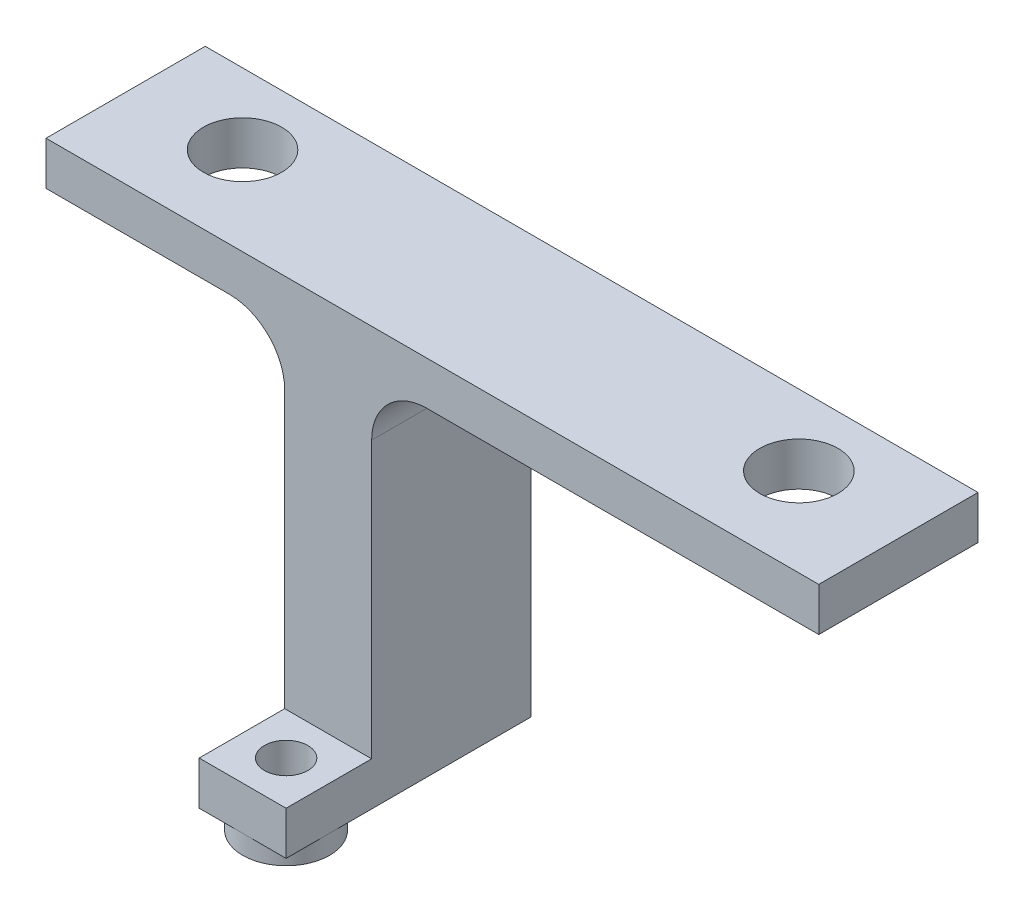
ISO-10303-21;
HEADER;
FILE_DESCRIPTION(('STEP AP214'),'2;1');
FILE_NAME('part.step','',(''),(''),'','','');
FILE_SCHEMA(('AUTOMOTIVE_DESIGN { 1 0 10303 214 1 1 1 1 }'));
ENDSEC;
DATA;
#1=APPLICATION_CONTEXT('core data for automotive mechanical design processes');
#2=APPLICATION_PROTOCOL_DEFINITION('international standard','automotive_design',2000,#1);
#3=PRODUCT_CONTEXT('',#1,'mechanical');
#4=PRODUCT('Part','Part','',(#3));
#5=PRODUCT_RELATED_PRODUCT_CATEGORY('part','',(#4));
#6=PRODUCT_DEFINITION_FORMATION('','',#4);
#7=PRODUCT_DEFINITION_CONTEXT('part definition',#1,'design');
#8=PRODUCT_DEFINITION('design','',#6,#7);
#9=PRODUCT_DEFINITION_SHAPE('','',#8);
#10=(LENGTH_UNIT() NAMED_UNIT(*) SI_UNIT(.MILLI.,.METRE.));
#11=(NAMED_UNIT(*) PLANE_ANGLE_UNIT() SI_UNIT($,.RADIAN.));
#12=(NAMED_UNIT(*) SI_UNIT($,.STERADIAN.) SOLID_ANGLE_UNIT());
#13=UNCERTAINTY_MEASURE_WITH_UNIT(LENGTH_MEASURE(1.E-05),#10,'distance_accuracy_value','');
#14=(GEOMETRIC_REPRESENTATION_CONTEXT(3) GLOBAL_UNCERTAINTY_ASSIGNED_CONTEXT((#13)) GLOBAL_UNIT_ASSIGNED_CONTEXT((#10,
#11,#12)) REPRESENTATION_CONTEXT('',''));
#15=CARTESIAN_POINT('',(0.,0.,0.));
#16=DIRECTION('',(0.,0.,1.));
#17=DIRECTION('',(1.,0.,0.));
#18=AXIS2_PLACEMENT_3D('',#15,#16,#17);
#19=CARTESIAN_POINT('',(0.,0.,0.));
#20=DIRECTION('',(0.,-1.,0.));
#21=DIRECTION('',(0.,0.,-1.));
#22=AXIS2_PLACEMENT_3D('',#19,#20,#21);
#23=PLANE('',#22);
#24=CARTESIAN_POINT('',(16.,0.,0.));
#25=DIRECTION('',(0.,1.,0.));
#26=DIRECTION('',(0.,0.,1.));
#27=AXIS2_PLACEMENT_3D('',#24,#25,#26);
#28=CIRCLE('',#27,2.25);
#29=CARTESIAN_POINT('',(16.,0.,2.25));
#30=VERTEX_POINT('',#29);
#31=EDGE_CURVE('E293',#30,#30,#28,.T.);
#32=ORIENTED_EDGE('',*,*,#31,.T.);
#33=EDGE_LOOP('',(#32));
#34=FACE_BOUND('',#33,.T.);
#35=DIRECTION('',(0.,0.,1.));
#36=VECTOR('',#35,1.);
#37=CARTESIAN_POINT('',(-0.319400000000001,0.,0.));
#38=LINE('',#37,#36);
#39=CARTESIAN_POINT('',(-0.319400000000001,0.,5.08));
#40=VERTEX_POINT('',#39);
#41=CARTESIAN_POINT('',(-0.319400000000001,0.,-4.08));
#42=VERTEX_POINT('',#41);
#43=EDGE_CURVE('E156',#40,#42,#38,.F.);
#44=ORIENTED_EDGE('',*,*,#43,.T.);
#45=DIRECTION('',(-1.,0.,0.));
#46=VECTOR('',#45,1.);
#47=CARTESIAN_POINT('',(22.225,0.,-4.08));
#48=LINE('',#47,#46);
#49=CARTESIAN_POINT('',(22.225,0.,-4.08));
#50=VERTEX_POINT('',#49);
#51=EDGE_CURVE('E140',#50,#42,#48,.T.);
#52=ORIENTED_EDGE('',*,*,#51,.F.);
#53=DIRECTION('',(0.,0.,-1.));
#54=VECTOR('',#53,1.);
#55=CARTESIAN_POINT('',(22.225,0.,5.08));
#56=LINE('',#55,#54);
#57=CARTESIAN_POINT('',(22.225,0.,5.08));
#58=VERTEX_POINT('',#57);
#59=EDGE_CURVE('E154',#58,#50,#56,.T.);
#60=ORIENTED_EDGE('',*,*,#59,.F.);
#61=DIRECTION('',(1.,0.,0.));
#62=VECTOR('',#61,1.);
#63=CARTESIAN_POINT('',(-22.225,0.,5.08));
#64=LINE('',#63,#62);
#65=EDGE_CURVE('E170',#40,#58,#64,.T.);
#66=ORIENTED_EDGE('',*,*,#65,.F.);
#67=EDGE_LOOP('',(#44,#52,#60,#66));
#68=FACE_BOUND('',#67,.T.);
#69=ADVANCED_FACE('F39',(#34,#68),#23,.T.);
#70=CARTESIAN_POINT('',(0.,2.5,0.));
#71=DIRECTION('',(0.,-1.,0.));
#72=DIRECTION('',(0.,0.,-1.));
#73=AXIS2_PLACEMENT_3D('',#70,#71,#72);
#74=PLANE('',#73);
#75=CARTESIAN_POINT('',(16.,2.5,0.));
#76=DIRECTION('',(0.,1.,0.));
#77=DIRECTION('',(0.,0.,1.));
#78=AXIS2_PLACEMENT_3D('',#75,#76,#77);
#79=CIRCLE('',#78,2.25);
#80=CARTESIAN_POINT('',(16.,2.5,2.25));
#81=VERTEX_POINT('',#80);
#82=EDGE_CURVE('E294',#81,#81,#79,.T.);
#83=ORIENTED_EDGE('',*,*,#82,.F.);
#84=EDGE_LOOP('',(#83));
#85=FACE_BOUND('',#84,.T.);
#86=CARTESIAN_POINT('',(-16.,2.5,0.));
#87=DIRECTION('',(0.,1.,0.));
#88=DIRECTION('',(0.,0.,1.));
#89=AXIS2_PLACEMENT_3D('',#86,#87,#88);
#90=CIRCLE('',#89,2.25);
#91=CARTESIAN_POINT('',(-16.,2.5,2.25));
#92=VERTEX_POINT('',#91);
#93=EDGE_CURVE('E166',#92,#92,#90,.T.);
#94=ORIENTED_EDGE('',*,*,#93,.F.);
#95=EDGE_LOOP('',(#94));
#96=FACE_BOUND('',#95,.T.);
#97=DIRECTION('',(1.,0.,0.));
#98=VECTOR('',#97,1.);
#99=CARTESIAN_POINT('',(-22.225,2.5,-4.08));
#100=LINE('',#99,#98);
#101=CARTESIAN_POINT('',(-22.225,2.5,-4.08));
#102=VERTEX_POINT('',#101);
#103=CARTESIAN_POINT('',(22.225,2.5,-4.08));
#104=VERTEX_POINT('',#103);
#105=EDGE_CURVE('E143',#102,#104,#100,.T.);
#106=ORIENTED_EDGE('',*,*,#105,.F.);
#107=DIRECTION('',(0.,0.,1.));
#108=VECTOR('',#107,1.);
#109=CARTESIAN_POINT('',(-22.225,2.5,5.08));
#110=LINE('',#109,#108);
#111=CARTESIAN_POINT('',(-22.225,2.5,5.08));
#112=VERTEX_POINT('',#111);
#113=EDGE_CURVE('E305',#102,#112,#110,.T.);
#114=ORIENTED_EDGE('',*,*,#113,.T.);
#115=DIRECTION('',(1.,0.,0.));
#116=VECTOR('',#115,1.);
#117=CARTESIAN_POINT('',(-22.225,2.5,5.08));
#118=LINE('',#117,#116);
#119=CARTESIAN_POINT('',(22.225,2.5,5.08));
#120=VERTEX_POINT('',#119);
#121=EDGE_CURVE('E176',#112,#120,#118,.T.);
#122=ORIENTED_EDGE('',*,*,#121,.T.);
#123=DIRECTION('',(0.,0.,-1.));
#124=VECTOR('',#123,1.);
#125=CARTESIAN_POINT('',(22.225,2.5,5.08));
#126=LINE('',#125,#124);
#127=EDGE_CURVE('E182',#120,#104,#126,.T.);
#128=ORIENTED_EDGE('',*,*,#127,.T.);
#129=EDGE_LOOP('',(#106,#114,#122,#128));
#130=FACE_BOUND('',#129,.T.);
#131=ADVANCED_FACE('F312',(#85,#96,#130),#74,.F.);
#132=CARTESIAN_POINT('',(-16.,0.,0.));
#133=DIRECTION('',(0.,1.,0.));
#134=DIRECTION('',(0.,0.,1.));
#135=AXIS2_PLACEMENT_3D('',#132,#133,#134);
#136=CIRCLE('',#135,2.25);
#137=CARTESIAN_POINT('',(-16.,0.,2.25));
#138=VERTEX_POINT('',#137);
#139=EDGE_CURVE('E173',#138,#138,#136,.T.);
#140=ORIENTED_EDGE('',*,*,#139,.T.);
#141=EDGE_LOOP('',(#140));
#142=FACE_BOUND('',#141,.T.);
#143=DIRECTION('',(0.,0.,1.));
#144=VECTOR('',#143,1.);
#145=CARTESIAN_POINT('',(-22.225,0.,5.08));
#146=LINE('',#145,#144);
#147=CARTESIAN_POINT('',(-22.225,0.,-4.08));
#148=VERTEX_POINT('',#147);
#149=CARTESIAN_POINT('',(-22.225,0.,5.08));
#150=VERTEX_POINT('',#149);
#151=EDGE_CURVE('E165',#148,#150,#146,.T.);
#152=ORIENTED_EDGE('',*,*,#151,.F.);
#153=DIRECTION('',(-1.,0.,0.));
#154=VECTOR('',#153,1.);
#155=CARTESIAN_POINT('',(-11.6694,0.,-4.08));
#156=LINE('',#155,#154);
#157=CARTESIAN_POINT('',(-11.6694,0.,-4.08));
#158=VERTEX_POINT('',#157);
#159=EDGE_CURVE('E227',#158,#148,#156,.T.);
#160=ORIENTED_EDGE('',*,*,#159,.F.);
#161=DIRECTION('',(0.,0.,-1.));
#162=VECTOR('',#161,1.);
#163=CARTESIAN_POINT('',(-11.6694,0.,0.));
#164=LINE('',#163,#162);
#165=CARTESIAN_POINT('',(-11.6694,0.,5.08));
#166=VERTEX_POINT('',#165);
#167=EDGE_CURVE('E63',#158,#166,#164,.F.);
#168=ORIENTED_EDGE('',*,*,#167,.T.);
#169=EDGE_CURVE('E179',#150,#166,#64,.T.);
#170=ORIENTED_EDGE('',*,*,#169,.F.);
#171=EDGE_LOOP('',(#152,#160,#168,#170));
#172=FACE_BOUND('',#171,.T.);
#173=ADVANCED_FACE('F316',(#142,#172),#23,.T.);
#174=CARTESIAN_POINT('',(22.225,2.5,5.08));
#175=DIRECTION('',(-1.,0.,0.));
#176=DIRECTION('',(0.,0.,1.));
#177=AXIS2_PLACEMENT_3D('',#174,#175,#176);
#178=PLANE('',#177);
#179=DIRECTION('',(0.,-1.,0.));
#180=VECTOR('',#179,1.);
#181=CARTESIAN_POINT('',(22.225,2.5,-4.08));
#182=LINE('',#181,#180);
#183=EDGE_CURVE('E137',#104,#50,#182,.T.);
#184=ORIENTED_EDGE('',*,*,#183,.F.);
#185=ORIENTED_EDGE('',*,*,#127,.F.);
#186=DIRECTION('',(0.,-1.,0.));
#187=VECTOR('',#186,1.);
#188=CARTESIAN_POINT('',(22.225,2.5,5.08));
#189=LINE('',#188,#187);
#190=EDGE_CURVE('E163',#120,#58,#189,.T.);
#191=ORIENTED_EDGE('',*,*,#190,.T.);
#192=ORIENTED_EDGE('',*,*,#59,.T.);
#193=EDGE_LOOP('',(#184,#185,#191,#192));
#194=FACE_BOUND('',#193,.T.);
#195=ADVANCED_FACE('F161',(#194),#178,.F.);
#196=CARTESIAN_POINT('',(-22.225,2.5,5.08));
#197=DIRECTION('',(1.,0.,0.));
#198=DIRECTION('',(0.,0.,-1.));
#199=AXIS2_PLACEMENT_3D('',#196,#197,#198);
#200=PLANE('',#199);
#201=DIRECTION('',(0.,1.,0.));
#202=VECTOR('',#201,1.);
#203=CARTESIAN_POINT('',(-22.225,0.,-4.08));
#204=LINE('',#203,#202);
#205=EDGE_CURVE('E230',#148,#102,#204,.T.);
#206=ORIENTED_EDGE('',*,*,#205,.F.);
#207=ORIENTED_EDGE('',*,*,#151,.T.);
#208=DIRECTION('',(0.,-1.,0.));
#209=VECTOR('',#208,1.);
#210=CARTESIAN_POINT('',(-22.225,2.5,5.08));
#211=LINE('',#210,#209);
#212=EDGE_CURVE('E185',#112,#150,#211,.T.);
#213=ORIENTED_EDGE('',*,*,#212,.F.);
#214=ORIENTED_EDGE('',*,*,#113,.F.);
#215=EDGE_LOOP('',(#206,#207,#213,#214));
#216=FACE_BOUND('',#215,.T.);
#217=ADVANCED_FACE('F318',(#216),#200,.F.);
#218=CARTESIAN_POINT('',(-3.4944,-19.05,-5.08));
#219=DIRECTION('',(-1.,0.,0.));
#220=DIRECTION('',(0.,0.,1.));
#221=AXIS2_PLACEMENT_3D('',#218,#219,#220);
#222=PLANE('',#221);
#223=DIRECTION('',(0.,-1.,0.));
#224=VECTOR('',#223,1.);
#225=CARTESIAN_POINT('',(-3.4944,-3.17500000000001,-4.08));
#226=LINE('',#225,#224);
#227=CARTESIAN_POINT('',(-3.4944,-3.17500000000001,-4.08));
#228=VERTEX_POINT('',#227);
#229=CARTESIAN_POINT('',(-3.4944,-21.55,-4.08));
#230=VERTEX_POINT('',#229);
#231=EDGE_CURVE('E214',#228,#230,#226,.T.);
#232=ORIENTED_EDGE('',*,*,#231,.F.);
#233=DIRECTION('',(0.,0.,1.));
#234=VECTOR('',#233,1.);
#235=CARTESIAN_POINT('',(-3.4944,-3.175,-5.08));
#236=LINE('',#235,#234);
#237=CARTESIAN_POINT('',(-3.4944,-3.17500000000001,5.08));
#238=VERTEX_POINT('',#237);
#239=EDGE_CURVE('E190',#228,#238,#236,.T.);
#240=ORIENTED_EDGE('',*,*,#239,.T.);
#241=DIRECTION('',(0.,1.,0.));
#242=VECTOR('',#241,1.);
#243=CARTESIAN_POINT('',(-3.4944,-19.05,5.08));
#244=LINE('',#243,#242);
#245=CARTESIAN_POINT('',(-3.4944,-19.05,5.08));
#246=VERTEX_POINT('',#245);
#247=EDGE_CURVE('E207',#246,#238,#244,.T.);
#248=ORIENTED_EDGE('',*,*,#247,.F.);
#249=DIRECTION('',(0.,0.,1.));
#250=VECTOR('',#249,1.);
#251=CARTESIAN_POINT('',(-3.4944,-19.05,10.));
#252=LINE('',#251,#250);
#253=CARTESIAN_POINT('',(-3.4944,-19.05,10.));
#254=VERTEX_POINT('',#253);
#255=EDGE_CURVE('E251',#246,#254,#252,.T.);
#256=ORIENTED_EDGE('',*,*,#255,.T.);
#257=DIRECTION('',(0.,1.,0.));
#258=VECTOR('',#257,1.);
#259=CARTESIAN_POINT('',(-3.4944,-21.55,10.));
#260=LINE('',#259,#258);
#261=CARTESIAN_POINT('',(-3.4944,-21.55,10.));
#262=VERTEX_POINT('',#261);
#263=EDGE_CURVE('E279',#262,#254,#260,.T.);
#264=ORIENTED_EDGE('',*,*,#263,.F.);
#265=DIRECTION('',(0.,0.,1.));
#266=VECTOR('',#265,1.);
#267=CARTESIAN_POINT('',(-3.4944,-21.55,10.));
#268=LINE('',#267,#266);
#269=CARTESIAN_POINT('',(-3.4944,-21.55,7.5));
#270=VERTEX_POINT('',#269);
#271=EDGE_CURVE('E256',#270,#262,#268,.T.);
#272=ORIENTED_EDGE('',*,*,#271,.F.);
#273=EDGE_CURVE('E252',#230,#270,#268,.T.);
#274=ORIENTED_EDGE('',*,*,#273,.F.);
#275=EDGE_LOOP('',(#232,#240,#248,#256,#264,#272,#274));
#276=FACE_BOUND('',#275,.T.);
#277=ADVANCED_FACE('F332',(#276),#222,.F.);
#278=CARTESIAN_POINT('',(-8.4944,-19.05,-5.08));
#279=DIRECTION('',(1.,0.,0.));
#280=DIRECTION('',(0.,0.,-1.));
#281=AXIS2_PLACEMENT_3D('',#278,#279,#280);
#282=PLANE('',#281);
#283=DIRECTION('',(0.,1.,0.));
#284=VECTOR('',#283,1.);
#285=CARTESIAN_POINT('',(-8.4944,-21.55,-4.08));
#286=LINE('',#285,#284);
#287=CARTESIAN_POINT('',(-8.4944,-21.55,-4.08));
#288=VERTEX_POINT('',#287);
#289=CARTESIAN_POINT('',(-8.4944,-3.175,-4.08));
#290=VERTEX_POINT('',#289);
#291=EDGE_CURVE('E55',#288,#290,#286,.T.);
#292=ORIENTED_EDGE('',*,*,#291,.F.);
#293=DIRECTION('',(0.,0.,-1.));
#294=VECTOR('',#293,1.);
#295=CARTESIAN_POINT('',(-8.4944,-21.55,10.));
#296=LINE('',#295,#294);
#297=CARTESIAN_POINT('',(-8.4944,-21.55,7.5));
#298=VERTEX_POINT('',#297);
#299=EDGE_CURVE('E261',#298,#288,#296,.T.);
#300=ORIENTED_EDGE('',*,*,#299,.F.);
#301=CARTESIAN_POINT('',(-8.4944,-21.55,10.));
#302=VERTEX_POINT('',#301);
#303=EDGE_CURVE('E262',#302,#298,#296,.T.);
#304=ORIENTED_EDGE('',*,*,#303,.F.);
#305=DIRECTION('',(0.,1.,0.));
#306=VECTOR('',#305,1.);
#307=CARTESIAN_POINT('',(-8.4944,-21.55,10.));
#308=LINE('',#307,#306);
#309=CARTESIAN_POINT('',(-8.4944,-19.05,10.));
#310=VERTEX_POINT('',#309);
#311=EDGE_CURVE('E266',#302,#310,#308,.T.);
#312=ORIENTED_EDGE('',*,*,#311,.T.);
#313=DIRECTION('',(0.,0.,-1.));
#314=VECTOR('',#313,1.);
#315=CARTESIAN_POINT('',(-8.4944,-19.05,10.));
#316=LINE('',#315,#314);
#317=CARTESIAN_POINT('',(-8.4944,-19.05,5.08));
#318=VERTEX_POINT('',#317);
#319=EDGE_CURVE('E272',#310,#318,#316,.T.);
#320=ORIENTED_EDGE('',*,*,#319,.T.);
#321=DIRECTION('',(0.,1.,0.));
#322=VECTOR('',#321,1.);
#323=CARTESIAN_POINT('',(-8.4944,-19.05,5.08));
#324=LINE('',#323,#322);
#325=CARTESIAN_POINT('',(-8.4944,-3.17500000000001,5.08));
#326=VERTEX_POINT('',#325);
#327=EDGE_CURVE('E287',#318,#326,#324,.T.);
#328=ORIENTED_EDGE('',*,*,#327,.T.);
#329=DIRECTION('',(0.,0.,-1.));
#330=VECTOR('',#329,1.);
#331=CARTESIAN_POINT('',(-8.4944,-3.175,-5.08));
#332=LINE('',#331,#330);
#333=EDGE_CURVE('E196',#326,#290,#332,.T.);
#334=ORIENTED_EDGE('',*,*,#333,.T.);
#335=EDGE_LOOP('',(#292,#300,#304,#312,#320,#328,#334));
#336=FACE_BOUND('',#335,.T.);
#337=ADVANCED_FACE('F322',(#336),#282,.F.);
#338=CARTESIAN_POINT('',(0.,-21.55,0.));
#339=DIRECTION('',(0.,-1.,0.));
#340=DIRECTION('',(0.,0.,-1.));
#341=AXIS2_PLACEMENT_3D('',#338,#339,#340);
#342=PLANE('',#341);
#343=ORIENTED_EDGE('',*,*,#299,.T.);
#344=DIRECTION('',(-1.,0.,0.));
#345=VECTOR('',#344,1.);
#346=CARTESIAN_POINT('',(-3.4944,-21.55,-4.08));
#347=LINE('',#346,#345);
#348=EDGE_CURVE('E217',#230,#288,#347,.T.);
#349=ORIENTED_EDGE('',*,*,#348,.F.);
#350=ORIENTED_EDGE('',*,*,#273,.T.);
#351=CARTESIAN_POINT('',(-5.9944,-21.55,7.5));
#352=DIRECTION('',(0.,-1.,0.));
#353=DIRECTION('',(0.,0.,-1.));
#354=AXIS2_PLACEMENT_3D('',#351,#352,#353);
#355=CIRCLE('',#354,2.5);
#356=EDGE_CURVE('E189',#298,#270,#355,.T.);
#357=ORIENTED_EDGE('',*,*,#356,.F.);
#358=EDGE_LOOP('',(#343,#349,#350,#357));
#359=FACE_BOUND('',#358,.T.);
#360=ADVANCED_FACE('F337',(#359),#342,.T.);
#361=CARTESIAN_POINT('',(-0.319400000000001,-3.175,-5.08));
#362=DIRECTION('',(0.,0.,1.));
#363=DIRECTION('',(1.,0.,0.));
#364=AXIS2_PLACEMENT_3D('',#361,#362,#363);
#365=CYLINDRICAL_SURFACE('',#364,3.175);
#366=CARTESIAN_POINT('',(-0.319400000000001,-3.175,-4.08));
#367=DIRECTION('',(0.,0.,1.));
#368=DIRECTION('',(-1.,0.,0.));
#369=AXIS2_PLACEMENT_3D('',#366,#367,#368);
#370=CIRCLE('',#369,3.175);
#371=EDGE_CURVE('E158',#42,#228,#370,.T.);
#372=ORIENTED_EDGE('',*,*,#371,.F.);
#373=ORIENTED_EDGE('',*,*,#43,.F.);
#374=CARTESIAN_POINT('',(-0.3194,-3.175,5.08));
#375=DIRECTION('',(0.,0.,-1.));
#376=DIRECTION('',(-1.,0.,0.));
#377=AXIS2_PLACEMENT_3D('',#374,#375,#376);
#378=CIRCLE('',#377,3.175);
#379=EDGE_CURVE('E48',#238,#40,#378,.T.);
#380=ORIENTED_EDGE('',*,*,#379,.F.);
#381=ORIENTED_EDGE('',*,*,#239,.F.);
#382=EDGE_LOOP('',(#372,#373,#380,#381));
#383=FACE_BOUND('',#382,.T.);
#384=ADVANCED_FACE('F211',(#383),#365,.F.);
#385=CARTESIAN_POINT('',(-11.6694,-3.175,-5.08));
#386=DIRECTION('',(0.,0.,-1.));
#387=DIRECTION('',(-1.,0.,0.));
#388=AXIS2_PLACEMENT_3D('',#385,#386,#387);
#389=CYLINDRICAL_SURFACE('',#388,3.175);
#390=CARTESIAN_POINT('',(-11.6694,-3.175,-4.08));
#391=DIRECTION('',(0.,0.,1.));
#392=DIRECTION('',(-1.,0.,0.));
#393=AXIS2_PLACEMENT_3D('',#390,#391,#392);
#394=CIRCLE('',#393,3.175);
#395=EDGE_CURVE('E224',#290,#158,#394,.T.);
#396=ORIENTED_EDGE('',*,*,#395,.F.);
#397=ORIENTED_EDGE('',*,*,#333,.F.);
#398=CARTESIAN_POINT('',(-11.6694,-3.175,5.08));
#399=DIRECTION('',(0.,0.,-1.));
#400=DIRECTION('',(-1.,0.,0.));
#401=AXIS2_PLACEMENT_3D('',#398,#399,#400);
#402=CIRCLE('',#401,3.175);
#403=EDGE_CURVE('E11',#166,#326,#402,.T.);
#404=ORIENTED_EDGE('',*,*,#403,.F.);
#405=ORIENTED_EDGE('',*,*,#167,.F.);
#406=EDGE_LOOP('',(#396,#397,#404,#405));
#407=FACE_BOUND('',#406,.T.);
#408=ADVANCED_FACE('F41',(#407),#389,.F.);
#409=CARTESIAN_POINT('',(-5.9944,-21.55,10.));
#410=VERTEX_POINT('',#409);
#411=EDGE_CURVE('E239',#270,#410,#355,.T.);
#412=ORIENTED_EDGE('',*,*,#411,.F.);
#413=ORIENTED_EDGE('',*,*,#271,.T.);
#414=DIRECTION('',(-1.,0.,0.));
#415=VECTOR('',#414,1.);
#416=CARTESIAN_POINT('',(-8.4944,-21.55,10.));
#417=LINE('',#416,#415);
#418=EDGE_CURVE('E257',#262,#410,#417,.T.);
#419=ORIENTED_EDGE('',*,*,#418,.T.);
#420=EDGE_LOOP('',(#412,#413,#419));
#421=FACE_BOUND('',#420,.T.);
#422=ADVANCED_FACE('F346',(#421),#342,.T.);
#423=EDGE_CURVE('E193',#410,#298,#355,.T.);
#424=ORIENTED_EDGE('',*,*,#423,.F.);
#425=EDGE_CURVE('E255',#410,#302,#417,.T.);
#426=ORIENTED_EDGE('',*,*,#425,.T.);
#427=ORIENTED_EDGE('',*,*,#303,.T.);
#428=EDGE_LOOP('',(#424,#426,#427));
#429=FACE_BOUND('',#428,.T.);
#430=ADVANCED_FACE('F352',(#429),#342,.T.);
#431=CARTESIAN_POINT('',(-22.225,2.5,5.08));
#432=DIRECTION('',(0.,0.,-1.));
#433=DIRECTION('',(-1.,0.,0.));
#434=AXIS2_PLACEMENT_3D('',#431,#432,#433);
#435=PLANE('',#434);
#436=ORIENTED_EDGE('',*,*,#169,.T.);
#437=ORIENTED_EDGE('',*,*,#403,.T.);
#438=ORIENTED_EDGE('',*,*,#327,.F.);
#439=DIRECTION('',(-1.,0.,0.));
#440=VECTOR('',#439,1.);
#441=CARTESIAN_POINT('',(-8.4944,-19.05,5.08));
#442=LINE('',#441,#440);
#443=EDGE_CURVE('E283',#246,#318,#442,.T.);
#444=ORIENTED_EDGE('',*,*,#443,.F.);
#445=ORIENTED_EDGE('',*,*,#247,.T.);
#446=ORIENTED_EDGE('',*,*,#379,.T.);
#447=ORIENTED_EDGE('',*,*,#65,.T.);
#448=ORIENTED_EDGE('',*,*,#190,.F.);
#449=ORIENTED_EDGE('',*,*,#121,.F.);
#450=ORIENTED_EDGE('',*,*,#212,.T.);
#451=EDGE_LOOP('',(#436,#437,#438,#444,#445,#446,#447,#448,#449,#450));
#452=FACE_BOUND('',#451,.T.);
#453=ADVANCED_FACE('F205',(#452),#435,.F.);
#454=CARTESIAN_POINT('',(-16.,2.5,0.));
#455=DIRECTION('',(0.,-1.,0.));
#456=DIRECTION('',(0.,0.,-1.));
#457=AXIS2_PLACEMENT_3D('',#454,#455,#456);
#458=CYLINDRICAL_SURFACE('',#457,2.25);
#459=ORIENTED_EDGE('',*,*,#93,.T.);
#460=EDGE_LOOP('',(#459));
#461=FACE_BOUND('',#460,.T.);
#462=ORIENTED_EDGE('',*,*,#139,.F.);
#463=EDGE_LOOP('',(#462));
#464=FACE_BOUND('',#463,.T.);
#465=ADVANCED_FACE('F389',(#461,#464),#458,.F.);
#466=CARTESIAN_POINT('',(16.,2.5,0.));
#467=DIRECTION('',(0.,-1.,0.));
#468=DIRECTION('',(0.,0.,-1.));
#469=AXIS2_PLACEMENT_3D('',#466,#467,#468);
#470=CYLINDRICAL_SURFACE('',#469,2.25);
#471=ORIENTED_EDGE('',*,*,#82,.T.);
#472=EDGE_LOOP('',(#471));
#473=FACE_BOUND('',#472,.T.);
#474=ORIENTED_EDGE('',*,*,#31,.F.);
#475=EDGE_LOOP('',(#474));
#476=FACE_BOUND('',#475,.T.);
#477=ADVANCED_FACE('F391',(#473,#476),#470,.F.);
#478=CARTESIAN_POINT('',(0.,-19.05,0.));
#479=DIRECTION('',(0.,-1.,0.));
#480=DIRECTION('',(0.,0.,-1.));
#481=AXIS2_PLACEMENT_3D('',#478,#479,#480);
#482=PLANE('',#481);
#483=CARTESIAN_POINT('',(-5.9944,-19.05,7.5));
#484=DIRECTION('',(0.,-1.,0.));
#485=DIRECTION('',(0.,0.,-1.));
#486=AXIS2_PLACEMENT_3D('',#483,#484,#485);
#487=CIRCLE('',#486,1.25);
#488=CARTESIAN_POINT('',(-5.9944,-19.05,6.25));
#489=VERTEX_POINT('',#488);
#490=EDGE_CURVE('E244',#489,#489,#487,.T.);
#491=ORIENTED_EDGE('',*,*,#490,.T.);
#492=EDGE_LOOP('',(#491));
#493=FACE_BOUND('',#492,.T.);
#494=ORIENTED_EDGE('',*,*,#255,.F.);
#495=ORIENTED_EDGE('',*,*,#443,.T.);
#496=ORIENTED_EDGE('',*,*,#319,.F.);
#497=DIRECTION('',(-1.,0.,0.));
#498=VECTOR('',#497,1.);
#499=CARTESIAN_POINT('',(-8.4944,-19.05,10.));
#500=LINE('',#499,#498);
#501=EDGE_CURVE('E269',#254,#310,#500,.T.);
#502=ORIENTED_EDGE('',*,*,#501,.F.);
#503=EDGE_LOOP('',(#494,#495,#496,#502));
#504=FACE_BOUND('',#503,.T.);
#505=ADVANCED_FACE('F328',(#493,#504),#482,.F.);
#506=CARTESIAN_POINT('',(-8.4944,-21.55,10.));
#507=DIRECTION('',(0.,0.,-1.));
#508=DIRECTION('',(-1.,0.,0.));
#509=AXIS2_PLACEMENT_3D('',#506,#507,#508);
#510=PLANE('',#509);
#511=ORIENTED_EDGE('',*,*,#501,.T.);
#512=ORIENTED_EDGE('',*,*,#311,.F.);
#513=ORIENTED_EDGE('',*,*,#425,.F.);
#514=ORIENTED_EDGE('',*,*,#418,.F.);
#515=ORIENTED_EDGE('',*,*,#263,.T.);
#516=EDGE_LOOP('',(#511,#512,#513,#514,#515));
#517=FACE_BOUND('',#516,.T.);
#518=ADVANCED_FACE('F349',(#517),#510,.F.);
#519=CARTESIAN_POINT('',(-5.9944,-21.55,7.5));
#520=DIRECTION('',(0.,1.,0.));
#521=DIRECTION('',(0.,0.,1.));
#522=AXIS2_PLACEMENT_3D('',#519,#520,#521);
#523=CYLINDRICAL_SURFACE('',#522,1.25);
#524=ORIENTED_EDGE('',*,*,#490,.F.);
#525=EDGE_LOOP('',(#524));
#526=FACE_BOUND('',#525,.T.);
#527=CARTESIAN_POINT('',(-5.9944,-22.65,7.5));
#528=DIRECTION('',(0.,-1.,0.));
#529=DIRECTION('',(0.,0.,-1.));
#530=AXIS2_PLACEMENT_3D('',#527,#528,#529);
#531=CIRCLE('',#530,1.25);
#532=CARTESIAN_POINT('',(-5.9944,-22.65,6.25));
#533=VERTEX_POINT('',#532);
#534=EDGE_CURVE('E235',#533,#533,#531,.T.);
#535=ORIENTED_EDGE('',*,*,#534,.T.);
#536=EDGE_LOOP('',(#535));
#537=FACE_BOUND('',#536,.T.);
#538=ADVANCED_FACE('F367',(#526,#537),#523,.F.);
#539=CARTESIAN_POINT('',(-5.9944,-22.65,7.5));
#540=DIRECTION('',(0.,-1.,0.));
#541=DIRECTION('',(0.,0.,-1.));
#542=AXIS2_PLACEMENT_3D('',#539,#540,#541);
#543=PLANE('',#542);
#544=CARTESIAN_POINT('',(-5.9944,-22.65,7.5));
#545=DIRECTION('',(0.,-1.,0.));
#546=DIRECTION('',(0.,0.,-1.));
#547=AXIS2_PLACEMENT_3D('',#544,#545,#546);
#548=CIRCLE('',#547,2.5);
#549=CARTESIAN_POINT('',(-5.9944,-22.65,5.));
#550=VERTEX_POINT('',#549);
#551=EDGE_CURVE('E240',#550,#550,#548,.T.);
#552=ORIENTED_EDGE('',*,*,#551,.T.);
#553=EDGE_LOOP('',(#552));
#554=FACE_BOUND('',#553,.T.);
#555=ORIENTED_EDGE('',*,*,#534,.F.);
#556=EDGE_LOOP('',(#555));
#557=FACE_BOUND('',#556,.T.);
#558=ADVANCED_FACE('F359',(#554,#557),#543,.T.);
#559=CARTESIAN_POINT('',(-5.9944,-22.65,7.5));
#560=DIRECTION('',(0.,1.,0.));
#561=DIRECTION('',(0.,0.,1.));
#562=AXIS2_PLACEMENT_3D('',#559,#560,#561);
#563=CYLINDRICAL_SURFACE('',#562,2.5);
#564=ORIENTED_EDGE('',*,*,#551,.F.);
#565=EDGE_LOOP('',(#564));
#566=FACE_BOUND('',#565,.T.);
#567=ORIENTED_EDGE('',*,*,#411,.T.);
#568=ORIENTED_EDGE('',*,*,#423,.T.);
#569=ORIENTED_EDGE('',*,*,#356,.T.);
#570=EDGE_LOOP('',(#567,#568,#569));
#571=FACE_BOUND('',#570,.T.);
#572=ADVANCED_FACE('F357',(#566,#571),#563,.T.);
#573=CARTESIAN_POINT('',(-0.319400000000001,-3.175,-4.08));
#574=DIRECTION('',(0.,0.,-1.));
#575=DIRECTION('',(-1.,0.,0.));
#576=AXIS2_PLACEMENT_3D('',#573,#574,#575);
#577=PLANE('',#576);
#578=ORIENTED_EDGE('',*,*,#183,.T.);
#579=ORIENTED_EDGE('',*,*,#51,.T.);
#580=ORIENTED_EDGE('',*,*,#371,.T.);
#581=ORIENTED_EDGE('',*,*,#231,.T.);
#582=ORIENTED_EDGE('',*,*,#348,.T.);
#583=ORIENTED_EDGE('',*,*,#291,.T.);
#584=ORIENTED_EDGE('',*,*,#395,.T.);
#585=ORIENTED_EDGE('',*,*,#159,.T.);
#586=ORIENTED_EDGE('',*,*,#205,.T.);
#587=ORIENTED_EDGE('',*,*,#105,.T.);
#588=EDGE_LOOP('',(#578,#579,#580,#581,#582,#583,#584,#585,#586,#587));
#589=FACE_BOUND('',#588,.T.);
#590=ADVANCED_FACE('F139',(#589),#577,.T.);
#591=CLOSED_SHELL('',(#69,#131,#173,#195,#217,#277,#337,#360,#384,#408,#422,#430,#453,#465,#477,
#505,#518,#538,#558,#572,#590));
#592=MANIFOLD_SOLID_BREP('B2',#591);
#593=ADVANCED_BREP_SHAPE_REPRESENTATION('',(#18,#592),#14);
#594=SHAPE_DEFINITION_REPRESENTATION(#9,#593);
ENDSEC;
END-ISO-10303-21;
